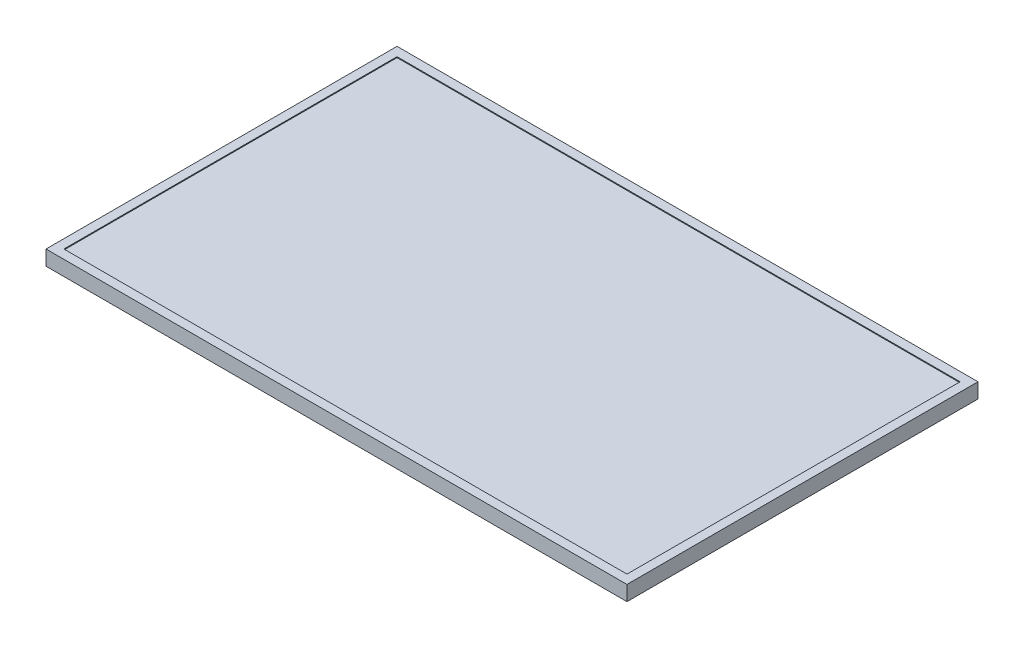
ISO-10303-21;
HEADER;
FILE_DESCRIPTION(('STEP AP214'),'2;1');
FILE_NAME('part.step','',(''),(''),'','','');
FILE_SCHEMA(('AUTOMOTIVE_DESIGN { 1 0 10303 214 1 1 1 1 }'));
ENDSEC;
DATA;
#1=APPLICATION_CONTEXT('core data for automotive mechanical design processes');
#2=APPLICATION_PROTOCOL_DEFINITION('international standard','automotive_design',2000,#1);
#3=PRODUCT_CONTEXT('',#1,'mechanical');
#4=PRODUCT('Part','Part','',(#3));
#5=PRODUCT_RELATED_PRODUCT_CATEGORY('part','',(#4));
#6=PRODUCT_DEFINITION_FORMATION('','',#4);
#7=PRODUCT_DEFINITION_CONTEXT('part definition',#1,'design');
#8=PRODUCT_DEFINITION('design','',#6,#7);
#9=PRODUCT_DEFINITION_SHAPE('','',#8);
#10=(LENGTH_UNIT() NAMED_UNIT(*) SI_UNIT(.MILLI.,.METRE.));
#11=(NAMED_UNIT(*) PLANE_ANGLE_UNIT() SI_UNIT($,.RADIAN.));
#12=(NAMED_UNIT(*) SI_UNIT($,.STERADIAN.) SOLID_ANGLE_UNIT());
#13=UNCERTAINTY_MEASURE_WITH_UNIT(LENGTH_MEASURE(1.E-05),#10,'distance_accuracy_value','');
#14=(GEOMETRIC_REPRESENTATION_CONTEXT(3) GLOBAL_UNCERTAINTY_ASSIGNED_CONTEXT((#13)) GLOBAL_UNIT_ASSIGNED_CONTEXT((#10,
#11,#12)) REPRESENTATION_CONTEXT('',''));
#15=CARTESIAN_POINT('',(0.,0.,0.));
#16=DIRECTION('',(0.,0.,1.));
#17=DIRECTION('',(1.,0.,0.));
#18=AXIS2_PLACEMENT_3D('',#15,#16,#17);
#19=CARTESIAN_POINT('',(0.,39.878,0.));
#20=DIRECTION('',(1.,0.,0.));
#21=DIRECTION('',(0.,0.,-1.));
#22=AXIS2_PLACEMENT_3D('',#19,#20,#21);
#23=PLANE('',#22);
#24=DIRECTION('',(0.,0.,1.));
#25=VECTOR('',#24,1.);
#26=CARTESIAN_POINT('',(0.,0.,0.));
#27=LINE('',#26,#25);
#28=CARTESIAN_POINT('',(0.,0.,-996.95));
#29=VERTEX_POINT('',#28);
#30=CARTESIAN_POINT('',(0.,0.,0.));
#31=VERTEX_POINT('',#30);
#32=EDGE_CURVE('E153',#29,#31,#27,.T.);
#33=ORIENTED_EDGE('',*,*,#32,.T.);
#34=DIRECTION('',(0.,-1.,0.));
#35=VECTOR('',#34,1.);
#36=CARTESIAN_POINT('',(0.,39.878,0.));
#37=LINE('',#36,#35);
#38=CARTESIAN_POINT('',(0.,42.418,0.));
#39=VERTEX_POINT('',#38);
#40=EDGE_CURVE('E11',#39,#31,#37,.T.);
#41=ORIENTED_EDGE('',*,*,#40,.F.);
#42=DIRECTION('',(0.,0.,1.));
#43=VECTOR('',#42,1.);
#44=CARTESIAN_POINT('',(0.,42.418,-996.95));
#45=LINE('',#44,#43);
#46=CARTESIAN_POINT('',(0.,42.418,-996.95));
#47=VERTEX_POINT('',#46);
#48=EDGE_CURVE('E144',#47,#39,#45,.T.);
#49=ORIENTED_EDGE('',*,*,#48,.F.);
#50=DIRECTION('',(0.,-1.,0.));
#51=VECTOR('',#50,1.);
#52=CARTESIAN_POINT('',(0.,39.878,-996.95));
#53=LINE('',#52,#51);
#54=EDGE_CURVE('E161',#47,#29,#53,.T.);
#55=ORIENTED_EDGE('',*,*,#54,.T.);
#56=EDGE_LOOP('',(#33,#41,#49,#55));
#57=FACE_BOUND('',#56,.T.);
#58=ADVANCED_FACE('F36',(#57),#23,.F.);
#59=CARTESIAN_POINT('',(0.,39.878,0.));
#60=DIRECTION('',(0.,0.,-1.));
#61=DIRECTION('',(-1.,0.,0.));
#62=AXIS2_PLACEMENT_3D('',#59,#60,#61);
#63=PLANE('',#62);
#64=DIRECTION('',(1.,0.,0.));
#65=VECTOR('',#64,1.);
#66=CARTESIAN_POINT('',(0.,0.,0.));
#67=LINE('',#66,#65);
#68=CARTESIAN_POINT('',(1649.984,0.,0.));
#69=VERTEX_POINT('',#68);
#70=EDGE_CURVE('E156',#31,#69,#67,.T.);
#71=ORIENTED_EDGE('',*,*,#70,.T.);
#72=DIRECTION('',(0.,-1.,0.));
#73=VECTOR('',#72,1.);
#74=CARTESIAN_POINT('',(1649.984,39.878,0.));
#75=LINE('',#74,#73);
#76=CARTESIAN_POINT('',(1649.984,42.418,0.));
#77=VERTEX_POINT('',#76);
#78=EDGE_CURVE('E43',#77,#69,#75,.T.);
#79=ORIENTED_EDGE('',*,*,#78,.F.);
#80=DIRECTION('',(1.,0.,0.));
#81=VECTOR('',#80,1.);
#82=CARTESIAN_POINT('',(0.,42.418,0.));
#83=LINE('',#82,#81);
#84=EDGE_CURVE('E147',#39,#77,#83,.T.);
#85=ORIENTED_EDGE('',*,*,#84,.F.);
#86=ORIENTED_EDGE('',*,*,#40,.T.);
#87=EDGE_LOOP('',(#71,#79,#85,#86));
#88=FACE_BOUND('',#87,.T.);
#89=ADVANCED_FACE('F179',(#88),#63,.F.);
#90=CARTESIAN_POINT('',(1649.984,39.878,0.));
#91=DIRECTION('',(-1.,0.,0.));
#92=DIRECTION('',(0.,0.,1.));
#93=AXIS2_PLACEMENT_3D('',#90,#91,#92);
#94=PLANE('',#93);
#95=DIRECTION('',(0.,0.,-1.));
#96=VECTOR('',#95,1.);
#97=CARTESIAN_POINT('',(1649.984,0.,0.));
#98=LINE('',#97,#96);
#99=CARTESIAN_POINT('',(1649.984,0.,-996.95));
#100=VERTEX_POINT('',#99);
#101=EDGE_CURVE('E158',#69,#100,#98,.T.);
#102=ORIENTED_EDGE('',*,*,#101,.T.);
#103=DIRECTION('',(0.,-1.,0.));
#104=VECTOR('',#103,1.);
#105=CARTESIAN_POINT('',(1649.984,39.878,-996.95));
#106=LINE('',#105,#104);
#107=CARTESIAN_POINT('',(1649.984,42.418,-996.95));
#108=VERTEX_POINT('',#107);
#109=EDGE_CURVE('E163',#108,#100,#106,.T.);
#110=ORIENTED_EDGE('',*,*,#109,.F.);
#111=DIRECTION('',(0.,0.,-1.));
#112=VECTOR('',#111,1.);
#113=CARTESIAN_POINT('',(1649.984,42.418,0.));
#114=LINE('',#113,#112);
#115=EDGE_CURVE('E150',#77,#108,#114,.T.);
#116=ORIENTED_EDGE('',*,*,#115,.F.);
#117=ORIENTED_EDGE('',*,*,#78,.T.);
#118=EDGE_LOOP('',(#102,#110,#116,#117));
#119=FACE_BOUND('',#118,.T.);
#120=ADVANCED_FACE('F168',(#119),#94,.F.);
#121=CARTESIAN_POINT('',(0.,39.878,-996.95));
#122=DIRECTION('',(0.,0.,1.));
#123=DIRECTION('',(1.,0.,0.));
#124=AXIS2_PLACEMENT_3D('',#121,#122,#123);
#125=PLANE('',#124);
#126=DIRECTION('',(-1.,0.,0.));
#127=VECTOR('',#126,1.);
#128=CARTESIAN_POINT('',(0.,0.,-996.95));
#129=LINE('',#128,#127);
#130=EDGE_CURVE('E58',#100,#29,#129,.T.);
#131=ORIENTED_EDGE('',*,*,#130,.T.);
#132=ORIENTED_EDGE('',*,*,#54,.F.);
#133=DIRECTION('',(-1.,0.,0.));
#134=VECTOR('',#133,1.);
#135=CARTESIAN_POINT('',(1649.984,42.418,-996.95));
#136=LINE('',#135,#134);
#137=EDGE_CURVE('E118',#108,#47,#136,.T.);
#138=ORIENTED_EDGE('',*,*,#137,.F.);
#139=ORIENTED_EDGE('',*,*,#109,.T.);
#140=EDGE_LOOP('',(#131,#132,#138,#139));
#141=FACE_BOUND('',#140,.T.);
#142=ADVANCED_FACE('F177',(#141),#125,.F.);
#143=CARTESIAN_POINT('',(0.,0.,0.));
#144=DIRECTION('',(0.,-1.,0.));
#145=DIRECTION('',(0.,0.,-1.));
#146=AXIS2_PLACEMENT_3D('',#143,#144,#145);
#147=PLANE('',#146);
#148=ORIENTED_EDGE('',*,*,#32,.F.);
#149=ORIENTED_EDGE('',*,*,#130,.F.);
#150=ORIENTED_EDGE('',*,*,#101,.F.);
#151=ORIENTED_EDGE('',*,*,#70,.F.);
#152=EDGE_LOOP('',(#148,#149,#150,#151));
#153=FACE_BOUND('',#152,.T.);
#154=ADVANCED_FACE('F173',(#153),#147,.T.);
#155=CARTESIAN_POINT('',(0.,42.418,0.));
#156=DIRECTION('',(0.,1.,0.));
#157=DIRECTION('',(0.,0.,1.));
#158=AXIS2_PLACEMENT_3D('',#155,#156,#157);
#159=PLANE('',#158);
#160=ORIENTED_EDGE('',*,*,#137,.T.);
#161=ORIENTED_EDGE('',*,*,#48,.T.);
#162=ORIENTED_EDGE('',*,*,#84,.T.);
#163=ORIENTED_EDGE('',*,*,#115,.T.);
#164=EDGE_LOOP('',(#160,#161,#162,#163));
#165=FACE_BOUND('',#164,.T.);
#166=DIRECTION('',(0.,0.,1.));
#167=VECTOR('',#166,1.);
#168=CARTESIAN_POINT('',(25.4,42.418,-971.55));
#169=LINE('',#168,#167);
#170=CARTESIAN_POINT('',(25.4,42.418,-971.55));
#171=VERTEX_POINT('',#170);
#172=CARTESIAN_POINT('',(25.4,42.418,-25.4));
#173=VERTEX_POINT('',#172);
#174=EDGE_CURVE('E110',#171,#173,#169,.T.);
#175=ORIENTED_EDGE('',*,*,#174,.F.);
#176=DIRECTION('',(-1.,0.,0.));
#177=VECTOR('',#176,1.);
#178=CARTESIAN_POINT('',(1624.584,42.418,-971.55));
#179=LINE('',#178,#177);
#180=CARTESIAN_POINT('',(1624.584,42.418,-971.55));
#181=VERTEX_POINT('',#180);
#182=EDGE_CURVE('E102',#181,#171,#179,.T.);
#183=ORIENTED_EDGE('',*,*,#182,.F.);
#184=DIRECTION('',(0.,0.,-1.));
#185=VECTOR('',#184,1.);
#186=CARTESIAN_POINT('',(1624.584,42.418,-25.4));
#187=LINE('',#186,#185);
#188=CARTESIAN_POINT('',(1624.584,42.418,-25.4));
#189=VERTEX_POINT('',#188);
#190=EDGE_CURVE('E126',#189,#181,#187,.T.);
#191=ORIENTED_EDGE('',*,*,#190,.F.);
#192=DIRECTION('',(1.,0.,0.));
#193=VECTOR('',#192,1.);
#194=CARTESIAN_POINT('',(25.4,42.418,-25.4));
#195=LINE('',#194,#193);
#196=EDGE_CURVE('E124',#173,#189,#195,.T.);
#197=ORIENTED_EDGE('',*,*,#196,.F.);
#198=EDGE_LOOP('',(#175,#183,#191,#197));
#199=FACE_BOUND('',#198,.T.);
#200=ADVANCED_FACE('F122',(#165,#199),#159,.T.);
#201=CARTESIAN_POINT('',(1624.584,42.418,-971.55));
#202=DIRECTION('',(0.,0.,1.));
#203=DIRECTION('',(1.,0.,0.));
#204=AXIS2_PLACEMENT_3D('',#201,#202,#203);
#205=PLANE('',#204);
#206=DIRECTION('',(-1.,0.,0.));
#207=VECTOR('',#206,1.);
#208=CARTESIAN_POINT('',(1624.584,39.878,-971.55));
#209=LINE('',#208,#207);
#210=CARTESIAN_POINT('',(1624.584,39.878,-971.55));
#211=VERTEX_POINT('',#210);
#212=CARTESIAN_POINT('',(25.4,39.878,-971.55));
#213=VERTEX_POINT('',#212);
#214=EDGE_CURVE('E130',#211,#213,#209,.T.);
#215=ORIENTED_EDGE('',*,*,#214,.F.);
#216=DIRECTION('',(0.,-1.,0.));
#217=VECTOR('',#216,1.);
#218=CARTESIAN_POINT('',(1624.584,42.418,-971.55));
#219=LINE('',#218,#217);
#220=EDGE_CURVE('E50',#181,#211,#219,.T.);
#221=ORIENTED_EDGE('',*,*,#220,.F.);
#222=ORIENTED_EDGE('',*,*,#182,.T.);
#223=DIRECTION('',(0.,-1.,0.));
#224=VECTOR('',#223,1.);
#225=CARTESIAN_POINT('',(25.4,42.418,-971.55));
#226=LINE('',#225,#224);
#227=EDGE_CURVE('E105',#171,#213,#226,.T.);
#228=ORIENTED_EDGE('',*,*,#227,.T.);
#229=EDGE_LOOP('',(#215,#221,#222,#228));
#230=FACE_BOUND('',#229,.T.);
#231=ADVANCED_FACE('F104',(#230),#205,.T.);
#232=CARTESIAN_POINT('',(25.4,42.418,-971.55));
#233=DIRECTION('',(1.,0.,0.));
#234=DIRECTION('',(0.,0.,-1.));
#235=AXIS2_PLACEMENT_3D('',#232,#233,#234);
#236=PLANE('',#235);
#237=DIRECTION('',(0.,0.,1.));
#238=VECTOR('',#237,1.);
#239=CARTESIAN_POINT('',(25.4,39.878,-971.55));
#240=LINE('',#239,#238);
#241=CARTESIAN_POINT('',(25.4,39.878,-25.4));
#242=VERTEX_POINT('',#241);
#243=EDGE_CURVE('E117',#213,#242,#240,.T.);
#244=ORIENTED_EDGE('',*,*,#243,.F.);
#245=ORIENTED_EDGE('',*,*,#227,.F.);
#246=ORIENTED_EDGE('',*,*,#174,.T.);
#247=DIRECTION('',(0.,-1.,0.));
#248=VECTOR('',#247,1.);
#249=CARTESIAN_POINT('',(25.4,42.418,-25.4));
#250=LINE('',#249,#248);
#251=EDGE_CURVE('E119',#173,#242,#250,.T.);
#252=ORIENTED_EDGE('',*,*,#251,.T.);
#253=EDGE_LOOP('',(#244,#245,#246,#252));
#254=FACE_BOUND('',#253,.T.);
#255=ADVANCED_FACE('F114',(#254),#236,.T.);
#256=CARTESIAN_POINT('',(25.4,42.418,-25.4));
#257=DIRECTION('',(0.,0.,-1.));
#258=DIRECTION('',(-1.,0.,0.));
#259=AXIS2_PLACEMENT_3D('',#256,#257,#258);
#260=PLANE('',#259);
#261=DIRECTION('',(1.,0.,0.));
#262=VECTOR('',#261,1.);
#263=CARTESIAN_POINT('',(25.4,39.878,-25.4));
#264=LINE('',#263,#262);
#265=CARTESIAN_POINT('',(1624.584,39.878,-25.4));
#266=VERTEX_POINT('',#265);
#267=EDGE_CURVE('E133',#242,#266,#264,.T.);
#268=ORIENTED_EDGE('',*,*,#267,.F.);
#269=ORIENTED_EDGE('',*,*,#251,.F.);
#270=ORIENTED_EDGE('',*,*,#196,.T.);
#271=DIRECTION('',(0.,-1.,0.));
#272=VECTOR('',#271,1.);
#273=CARTESIAN_POINT('',(1624.584,42.418,-25.4));
#274=LINE('',#273,#272);
#275=EDGE_CURVE('E139',#189,#266,#274,.T.);
#276=ORIENTED_EDGE('',*,*,#275,.T.);
#277=EDGE_LOOP('',(#268,#269,#270,#276));
#278=FACE_BOUND('',#277,.T.);
#279=ADVANCED_FACE('F202',(#278),#260,.T.);
#280=CARTESIAN_POINT('',(1624.584,42.418,-25.4));
#281=DIRECTION('',(-1.,0.,0.));
#282=DIRECTION('',(0.,0.,1.));
#283=AXIS2_PLACEMENT_3D('',#280,#281,#282);
#284=PLANE('',#283);
#285=DIRECTION('',(0.,0.,-1.));
#286=VECTOR('',#285,1.);
#287=CARTESIAN_POINT('',(1624.584,39.878,-25.4));
#288=LINE('',#287,#286);
#289=EDGE_CURVE('E111',#266,#211,#288,.T.);
#290=ORIENTED_EDGE('',*,*,#289,.F.);
#291=ORIENTED_EDGE('',*,*,#275,.F.);
#292=ORIENTED_EDGE('',*,*,#190,.T.);
#293=ORIENTED_EDGE('',*,*,#220,.T.);
#294=EDGE_LOOP('',(#290,#291,#292,#293));
#295=FACE_BOUND('',#294,.T.);
#296=ADVANCED_FACE('F194',(#295),#284,.T.);
#297=CARTESIAN_POINT('',(0.,39.878,0.));
#298=DIRECTION('',(0.,-1.,0.));
#299=DIRECTION('',(0.,0.,-1.));
#300=AXIS2_PLACEMENT_3D('',#297,#298,#299);
#301=PLANE('',#300);
#302=ORIENTED_EDGE('',*,*,#289,.T.);
#303=ORIENTED_EDGE('',*,*,#214,.T.);
#304=ORIENTED_EDGE('',*,*,#243,.T.);
#305=ORIENTED_EDGE('',*,*,#267,.T.);
#306=EDGE_LOOP('',(#302,#303,#304,#305));
#307=FACE_BOUND('',#306,.T.);
#308=ADVANCED_FACE('F191',(#307),#301,.F.);
#309=CLOSED_SHELL('',(#58,#89,#120,#142,#154,#200,#231,#255,#279,#296,#308));
#310=MANIFOLD_SOLID_BREP('B2',#309);
#311=ADVANCED_BREP_SHAPE_REPRESENTATION('',(#18,#310),#14);
#312=SHAPE_DEFINITION_REPRESENTATION(#9,#311);
ENDSEC;
END-ISO-10303-21;
